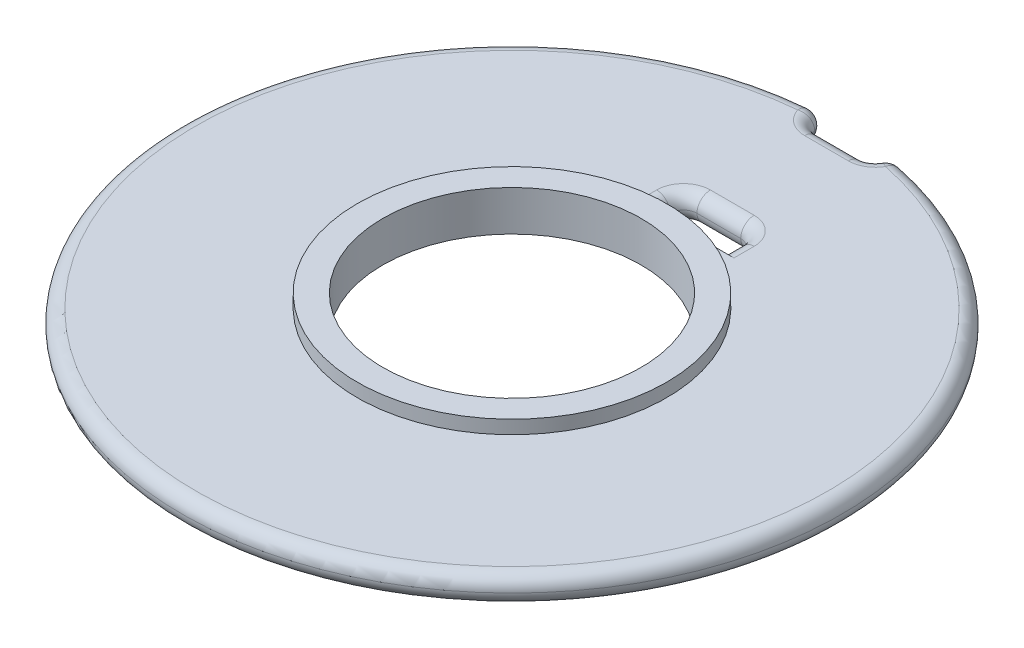
ISO-10303-21;
HEADER;
FILE_DESCRIPTION(('STEP AP214'),'2;1');
FILE_NAME('part.step','',(''),(''),'','','');
FILE_SCHEMA(('AUTOMOTIVE_DESIGN { 1 0 10303 214 1 1 1 1 }'));
ENDSEC;
DATA;
#1=APPLICATION_CONTEXT('core data for automotive mechanical design processes');
#2=APPLICATION_PROTOCOL_DEFINITION('international standard','automotive_design',2000,#1);
#3=PRODUCT_CONTEXT('',#1,'mechanical');
#4=PRODUCT('Part','Part','',(#3));
#5=PRODUCT_RELATED_PRODUCT_CATEGORY('part','',(#4));
#6=PRODUCT_DEFINITION_FORMATION('','',#4);
#7=PRODUCT_DEFINITION_CONTEXT('part definition',#1,'design');
#8=PRODUCT_DEFINITION('design','',#6,#7);
#9=PRODUCT_DEFINITION_SHAPE('','',#8);
#10=(LENGTH_UNIT() NAMED_UNIT(*) SI_UNIT(.MILLI.,.METRE.));
#11=(NAMED_UNIT(*) PLANE_ANGLE_UNIT() SI_UNIT($,.RADIAN.));
#12=(NAMED_UNIT(*) SI_UNIT($,.STERADIAN.) SOLID_ANGLE_UNIT());
#13=UNCERTAINTY_MEASURE_WITH_UNIT(LENGTH_MEASURE(1.E-05),#10,'distance_accuracy_value','');
#14=(GEOMETRIC_REPRESENTATION_CONTEXT(3) GLOBAL_UNCERTAINTY_ASSIGNED_CONTEXT((#13)) GLOBAL_UNIT_ASSIGNED_CONTEXT((#10,
#11,#12)) REPRESENTATION_CONTEXT('',''));
#15=CARTESIAN_POINT('',(0.,0.,0.));
#16=DIRECTION('',(0.,0.,1.));
#17=DIRECTION('',(1.,0.,0.));
#18=AXIS2_PLACEMENT_3D('',#15,#16,#17);
#19=CARTESIAN_POINT('',(9.6,-1.00000000000003,0.));
#20=DIRECTION('',(0.,1.,0.));
#21=DIRECTION('',(-1.,0.,0.));
#22=AXIS2_PLACEMENT_3D('',#19,#20,#21);
#23=PLANE('',#22);
#24=CARTESIAN_POINT('',(3.,-1.00000000000005,-24.));
#25=DIRECTION('',(0.,1.,0.));
#26=DIRECTION('',(-1.,0.,0.));
#27=AXIS2_PLACEMENT_3D('',#24,#25,#26);
#28=CIRCLE('',#27,2.);
#29=CARTESIAN_POINT('',(3.,-1.00000000000005,-22.));
#30=VERTEX_POINT('',#29);
#31=CARTESIAN_POINT('',(4.7415735544358,-1.00000000000004,-23.0166783056955));
#32=VERTEX_POINT('',#31);
#33=EDGE_CURVE('E159',#30,#32,#28,.T.);
#34=ORIENTED_EDGE('',*,*,#33,.T.);
#35=CARTESIAN_POINT('',(0.,-1.00000000000006,0.));
#36=DIRECTION('',(0.,1.,0.));
#37=DIRECTION('',(-1.,0.,0.));
#38=AXIS2_PLACEMENT_3D('',#35,#36,#37);
#39=CIRCLE('',#38,23.5);
#40=CARTESIAN_POINT('',(-2.15809742845385,-1.00000000000007,-23.4006969017869));
#41=VERTEX_POINT('',#40);
#42=EDGE_CURVE('E108',#32,#41,#39,.F.);
#43=ORIENTED_EDGE('',*,*,#42,.T.);
#44=CARTESIAN_POINT('',(-0.249999999999998,-1.00000000000006,-24.));
#45=DIRECTION('',(0.,1.,0.));
#46=DIRECTION('',(-1.,0.,0.));
#47=AXIS2_PLACEMENT_3D('',#44,#45,#46);
#48=CIRCLE('',#47,2.);
#49=CARTESIAN_POINT('',(-0.249999999999998,-1.00000000000006,-22.));
#50=VERTEX_POINT('',#49);
#51=EDGE_CURVE('E156',#41,#50,#48,.T.);
#52=ORIENTED_EDGE('',*,*,#51,.T.);
#53=DIRECTION('',(1.,0.,0.));
#54=VECTOR('',#53,1.);
#55=CARTESIAN_POINT('',(9.6,-1.00000000000003,-22.));
#56=LINE('',#55,#54);
#57=EDGE_CURVE('E162',#50,#30,#56,.T.);
#58=ORIENTED_EDGE('',*,*,#57,.T.);
#59=EDGE_LOOP('',(#34,#43,#52,#58));
#60=FACE_BOUND('',#59,.T.);
#61=DIRECTION('',(1.,0.,0.));
#62=VECTOR('',#61,1.);
#63=CARTESIAN_POINT('',(-1.25,-1.00000000000026,-11.5));
#64=LINE('',#63,#62);
#65=CARTESIAN_POINT('',(-2.25,-1.00000000000007,-11.5));
#66=VERTEX_POINT('',#65);
#67=CARTESIAN_POINT('',(5.,-1.00000000000004,-11.5));
#68=VERTEX_POINT('',#67);
#69=EDGE_CURVE('E258',#66,#68,#64,.T.);
#70=ORIENTED_EDGE('',*,*,#69,.T.);
#71=DIRECTION('',(0.,0.,-1.));
#72=VECTOR('',#71,1.);
#73=CARTESIAN_POINT('',(5.,-1.00000000000004,0.));
#74=LINE('',#73,#72);
#75=CARTESIAN_POINT('',(5.,-1.00000000000004,-13.));
#76=VERTEX_POINT('',#75);
#77=EDGE_CURVE('E231',#68,#76,#74,.T.);
#78=ORIENTED_EDGE('',*,*,#77,.T.);
#79=CARTESIAN_POINT('',(3.,-1.00000000000005,-13.));
#80=DIRECTION('',(0.,1.,0.));
#81=DIRECTION('',(-1.,0.,0.));
#82=AXIS2_PLACEMENT_3D('',#79,#80,#81);
#83=CIRCLE('',#82,2.);
#84=CARTESIAN_POINT('',(3.,-1.00000000000005,-15.));
#85=VERTEX_POINT('',#84);
#86=EDGE_CURVE('E234',#85,#76,#83,.F.);
#87=ORIENTED_EDGE('',*,*,#86,.F.);
#88=DIRECTION('',(-1.,0.,0.));
#89=VECTOR('',#88,1.);
#90=CARTESIAN_POINT('',(9.6,-1.00000000000003,-15.));
#91=LINE('',#90,#89);
#92=CARTESIAN_POINT('',(-0.249999999999998,-1.00000000000006,-15.));
#93=VERTEX_POINT('',#92);
#94=EDGE_CURVE('E240',#85,#93,#91,.T.);
#95=ORIENTED_EDGE('',*,*,#94,.T.);
#96=CARTESIAN_POINT('',(-0.249999999999998,-1.00000000000006,-13.));
#97=DIRECTION('',(0.,1.,0.));
#98=DIRECTION('',(-1.,0.,0.));
#99=AXIS2_PLACEMENT_3D('',#96,#97,#98);
#100=CIRCLE('',#99,2.);
#101=CARTESIAN_POINT('',(-2.25,-1.00000000000007,-13.));
#102=VERTEX_POINT('',#101);
#103=EDGE_CURVE('E243',#102,#93,#100,.F.);
#104=ORIENTED_EDGE('',*,*,#103,.F.);
#105=DIRECTION('',(0.,0.,1.));
#106=VECTOR('',#105,1.);
#107=CARTESIAN_POINT('',(-2.25,-1.00000000000007,0.));
#108=LINE('',#107,#106);
#109=EDGE_CURVE('E237',#102,#66,#108,.T.);
#110=ORIENTED_EDGE('',*,*,#109,.T.);
#111=EDGE_LOOP('',(#70,#78,#87,#95,#104,#110));
#112=FACE_BOUND('',#111,.T.);
#113=CARTESIAN_POINT('',(0.,-1.00000000000003,0.));
#114=DIRECTION('',(0.,1.,0.));
#115=DIRECTION('',(-1.,0.,0.));
#116=AXIS2_PLACEMENT_3D('',#113,#114,#115);
#117=CIRCLE('',#116,9.59999999999997);
#118=CARTESIAN_POINT('',(-9.59999999999995,-1.00000000000007,0.));
#119=VERTEX_POINT('',#118);
#120=EDGE_CURVE('E246',#119,#119,#117,.T.);
#121=ORIENTED_EDGE('',*,*,#120,.T.);
#122=EDGE_LOOP('',(#121));
#123=FACE_BOUND('',#122,.T.);
#124=ADVANCED_FACE('F37',(#60,#112,#123),#23,.F.);
#125=CARTESIAN_POINT('',(24.5,1.00000000000002,0.));
#126=DIRECTION('',(0.,-1.,0.));
#127=DIRECTION('',(1.,0.,0.));
#128=AXIS2_PLACEMENT_3D('',#125,#126,#127);
#129=PLANE('',#128);
#130=DIRECTION('',(0.,0.,-1.));
#131=VECTOR('',#130,1.);
#132=CARTESIAN_POINT('',(5.,0.999999999999953,0.));
#133=LINE('',#132,#131);
#134=CARTESIAN_POINT('',(5.,0.999999999999953,-13.));
#135=VERTEX_POINT('',#134);
#136=CARTESIAN_POINT('',(5.,0.999999999999953,-11.5));
#137=VERTEX_POINT('',#136);
#138=EDGE_CURVE('E216',#135,#137,#133,.F.);
#139=ORIENTED_EDGE('',*,*,#138,.T.);
#140=DIRECTION('',(1.,0.,0.));
#141=VECTOR('',#140,1.);
#142=CARTESIAN_POINT('',(-1.25,0.999999999999931,-11.5));
#143=LINE('',#142,#141);
#144=CARTESIAN_POINT('',(0.,0.999999999999936,-11.5));
#145=VERTEX_POINT('',#144);
#146=EDGE_CURVE('E169',#145,#137,#143,.T.);
#147=ORIENTED_EDGE('',*,*,#146,.F.);
#148=CARTESIAN_POINT('',(0.,0.999999999999957,0.));
#149=DIRECTION('',(0.,1.,0.));
#150=DIRECTION('',(-1.,0.,0.));
#151=AXIS2_PLACEMENT_3D('',#148,#149,#150);
#152=CIRCLE('',#151,11.5);
#153=EDGE_CURVE('E249',#145,#145,#152,.T.);
#154=ORIENTED_EDGE('',*,*,#153,.F.);
#155=CARTESIAN_POINT('',(-2.25,0.999999999999928,-11.5));
#156=VERTEX_POINT('',#155);
#157=EDGE_CURVE('E259',#156,#145,#143,.T.);
#158=ORIENTED_EDGE('',*,*,#157,.F.);
#159=DIRECTION('',(0.,0.,1.));
#160=VECTOR('',#159,1.);
#161=CARTESIAN_POINT('',(-2.25,0.999999999999928,0.));
#162=LINE('',#161,#160);
#163=CARTESIAN_POINT('',(-2.25,0.999999999999928,-13.));
#164=VERTEX_POINT('',#163);
#165=EDGE_CURVE('E219',#156,#164,#162,.F.);
#166=ORIENTED_EDGE('',*,*,#165,.T.);
#167=CARTESIAN_POINT('',(-0.250000000000005,0.999999999999934,-13.));
#168=DIRECTION('',(0.,-1.,0.));
#169=DIRECTION('',(1.,0.,0.));
#170=AXIS2_PLACEMENT_3D('',#167,#168,#169);
#171=CIRCLE('',#170,2.);
#172=CARTESIAN_POINT('',(-0.250000000000005,0.999999999999934,-15.));
#173=VERTEX_POINT('',#172);
#174=EDGE_CURVE('E222',#173,#164,#171,.F.);
#175=ORIENTED_EDGE('',*,*,#174,.F.);
#176=DIRECTION('',(-1.,0.,0.));
#177=VECTOR('',#176,1.);
#178=CARTESIAN_POINT('',(24.5,1.00000000000002,-15.));
#179=LINE('',#178,#177);
#180=CARTESIAN_POINT('',(3.,0.999999999999946,-15.));
#181=VERTEX_POINT('',#180);
#182=EDGE_CURVE('E225',#173,#181,#179,.F.);
#183=ORIENTED_EDGE('',*,*,#182,.T.);
#184=CARTESIAN_POINT('',(3.,0.999999999999946,-13.));
#185=DIRECTION('',(0.,-1.,0.));
#186=DIRECTION('',(1.,0.,0.));
#187=AXIS2_PLACEMENT_3D('',#184,#185,#186);
#188=CIRCLE('',#187,2.);
#189=EDGE_CURVE('E228',#135,#181,#188,.F.);
#190=ORIENTED_EDGE('',*,*,#189,.F.);
#191=EDGE_LOOP('',(#139,#147,#154,#158,#166,#175,#183,#190));
#192=FACE_BOUND('',#191,.T.);
#193=CARTESIAN_POINT('',(-0.250000000000005,0.999999999999934,-24.));
#194=DIRECTION('',(0.,-1.,0.));
#195=DIRECTION('',(1.,0.,0.));
#196=AXIS2_PLACEMENT_3D('',#193,#194,#195);
#197=CIRCLE('',#196,2.);
#198=CARTESIAN_POINT('',(-0.250000000000005,0.999999999999934,-22.));
#199=VERTEX_POINT('',#198);
#200=CARTESIAN_POINT('',(-2.15809742845386,0.999999999999928,-23.4006969017869));
#201=VERTEX_POINT('',#200);
#202=EDGE_CURVE('E102',#199,#201,#197,.T.);
#203=ORIENTED_EDGE('',*,*,#202,.T.);
#204=CARTESIAN_POINT('',(0.,0.999999999999936,0.));
#205=DIRECTION('',(0.,-1.,0.));
#206=DIRECTION('',(1.,0.,0.));
#207=AXIS2_PLACEMENT_3D('',#204,#205,#206);
#208=CIRCLE('',#207,23.5);
#209=CARTESIAN_POINT('',(4.74157355443579,0.999999999999952,-23.0166783056955));
#210=VERTEX_POINT('',#209);
#211=EDGE_CURVE('E56',#201,#210,#208,.F.);
#212=ORIENTED_EDGE('',*,*,#211,.T.);
#213=CARTESIAN_POINT('',(3.,0.999999999999946,-24.));
#214=DIRECTION('',(0.,-1.,0.));
#215=DIRECTION('',(1.,0.,0.));
#216=AXIS2_PLACEMENT_3D('',#213,#214,#215);
#217=CIRCLE('',#216,2.);
#218=CARTESIAN_POINT('',(3.,0.999999999999946,-22.));
#219=VERTEX_POINT('',#218);
#220=EDGE_CURVE('E115',#210,#219,#217,.T.);
#221=ORIENTED_EDGE('',*,*,#220,.T.);
#222=DIRECTION('',(1.,0.,0.));
#223=VECTOR('',#222,1.);
#224=CARTESIAN_POINT('',(24.5,1.00000000000002,-22.));
#225=LINE('',#224,#223);
#226=EDGE_CURVE('E114',#219,#199,#225,.F.);
#227=ORIENTED_EDGE('',*,*,#226,.T.);
#228=EDGE_LOOP('',(#203,#212,#221,#227));
#229=FACE_BOUND('',#228,.T.);
#230=ADVANCED_FACE('F112',(#192,#229),#129,.F.);
#231=CARTESIAN_POINT('',(0.,5.75529788456651,0.));
#232=DIRECTION('',(0.,1.,0.));
#233=DIRECTION('',(-1.,0.,0.));
#234=AXIS2_PLACEMENT_3D('',#231,#232,#233);
#235=CYLINDRICAL_SURFACE('',#234,11.5);
#236=CARTESIAN_POINT('',(0.,1.99999999999996,0.));
#237=DIRECTION('',(0.,1.,0.));
#238=DIRECTION('',(-1.,0.,0.));
#239=AXIS2_PLACEMENT_3D('',#236,#237,#238);
#240=CIRCLE('',#239,11.5);
#241=CARTESIAN_POINT('',(-11.5,1.99999999999992,0.));
#242=VERTEX_POINT('',#241);
#243=EDGE_CURVE('E252',#242,#242,#240,.T.);
#244=ORIENTED_EDGE('',*,*,#243,.F.);
#245=EDGE_LOOP('',(#244));
#246=FACE_BOUND('',#245,.T.);
#247=ORIENTED_EDGE('',*,*,#153,.T.);
#248=EDGE_LOOP('',(#247));
#249=FACE_BOUND('',#248,.T.);
#250=ADVANCED_FACE('F362',(#246,#249),#235,.T.);
#251=CARTESIAN_POINT('',(11.5,2.,0.));
#252=DIRECTION('',(0.,-1.,0.));
#253=DIRECTION('',(1.,0.,0.));
#254=AXIS2_PLACEMENT_3D('',#251,#252,#253);
#255=PLANE('',#254);
#256=CARTESIAN_POINT('',(0.,1.99999999999996,0.));
#257=DIRECTION('',(0.,1.,0.));
#258=DIRECTION('',(-1.,0.,0.));
#259=AXIS2_PLACEMENT_3D('',#256,#257,#258);
#260=CIRCLE('',#259,9.59999999999999);
#261=CARTESIAN_POINT('',(-9.59999999999997,1.99999999999993,0.));
#262=VERTEX_POINT('',#261);
#263=EDGE_CURVE('E255',#262,#262,#260,.T.);
#264=ORIENTED_EDGE('',*,*,#263,.F.);
#265=EDGE_LOOP('',(#264));
#266=FACE_BOUND('',#265,.T.);
#267=ORIENTED_EDGE('',*,*,#243,.T.);
#268=EDGE_LOOP('',(#267));
#269=FACE_BOUND('',#268,.T.);
#270=ADVANCED_FACE('F563',(#266,#269),#255,.F.);
#271=CARTESIAN_POINT('',(0.,5.75529788456651,0.));
#272=DIRECTION('',(0.,1.,0.));
#273=DIRECTION('',(-1.,0.,0.));
#274=AXIS2_PLACEMENT_3D('',#271,#272,#273);
#275=CYLINDRICAL_SURFACE('',#274,9.59999999999998);
#276=ORIENTED_EDGE('',*,*,#120,.F.);
#277=EDGE_LOOP('',(#276));
#278=FACE_BOUND('',#277,.T.);
#279=ORIENTED_EDGE('',*,*,#263,.T.);
#280=EDGE_LOOP('',(#279));
#281=FACE_BOUND('',#280,.T.);
#282=ADVANCED_FACE('F554',(#278,#281),#275,.F.);
#283=CARTESIAN_POINT('',(-1.25,-1.00000000000026,-11.5));
#284=DIRECTION('',(0.,0.,1.));
#285=DIRECTION('',(1.,0.,0.));
#286=AXIS2_PLACEMENT_3D('',#283,#284,#285);
#287=PLANE('',#286);
#288=ORIENTED_EDGE('',*,*,#157,.T.);
#289=ORIENTED_EDGE('',*,*,#146,.T.);
#290=CARTESIAN_POINT('',(5.,0.,-11.5));
#291=DIRECTION('',(0.,0.,1.));
#292=DIRECTION('',(1.,0.,0.));
#293=AXIS2_PLACEMENT_3D('',#290,#291,#292);
#294=CIRCLE('',#293,1.);
#295=CARTESIAN_POINT('',(4.,0.,-11.5));
#296=VERTEX_POINT('',#295);
#297=EDGE_CURVE('E210',#137,#296,#294,.T.);
#298=ORIENTED_EDGE('',*,*,#297,.T.);
#299=CARTESIAN_POINT('',(5.,0.,-11.5));
#300=DIRECTION('',(0.,0.,1.));
#301=DIRECTION('',(1.,0.,0.));
#302=AXIS2_PLACEMENT_3D('',#299,#300,#301);
#303=CIRCLE('',#302,1.);
#304=EDGE_CURVE('E213',#296,#68,#303,.T.);
#305=ORIENTED_EDGE('',*,*,#304,.T.);
#306=ORIENTED_EDGE('',*,*,#69,.F.);
#307=CARTESIAN_POINT('',(-2.25,0.,-11.5));
#308=DIRECTION('',(0.,0.,1.));
#309=DIRECTION('',(1.,0.,0.));
#310=AXIS2_PLACEMENT_3D('',#307,#308,#309);
#311=CIRCLE('',#310,1.);
#312=CARTESIAN_POINT('',(-1.25,0.,-11.5));
#313=VERTEX_POINT('',#312);
#314=EDGE_CURVE('E207',#66,#313,#311,.T.);
#315=ORIENTED_EDGE('',*,*,#314,.T.);
#316=CARTESIAN_POINT('',(-2.25,0.,-11.5));
#317=DIRECTION('',(0.,0.,1.));
#318=DIRECTION('',(1.,0.,0.));
#319=AXIS2_PLACEMENT_3D('',#316,#317,#318);
#320=CIRCLE('',#319,1.);
#321=EDGE_CURVE('E165',#313,#156,#320,.T.);
#322=ORIENTED_EDGE('',*,*,#321,.T.);
#323=EDGE_LOOP('',(#288,#289,#298,#305,#306,#315,#322));
#324=FACE_BOUND('',#323,.T.);
#325=ADVANCED_FACE('F278',(#324),#287,.F.);
#326=CARTESIAN_POINT('',(-2.25,0.,-14.));
#327=DIRECTION('',(0.,0.,1.));
#328=DIRECTION('',(1.,0.,0.));
#329=AXIS2_PLACEMENT_3D('',#326,#327,#328);
#330=CYLINDRICAL_SURFACE('',#329,1.);
#331=ORIENTED_EDGE('',*,*,#165,.F.);
#332=ORIENTED_EDGE('',*,*,#321,.F.);
#333=DIRECTION('',(0.,0.,1.));
#334=VECTOR('',#333,1.);
#335=CARTESIAN_POINT('',(-1.25,0.,-14.));
#336=LINE('',#335,#334);
#337=CARTESIAN_POINT('',(-1.25,0.,-13.));
#338=VERTEX_POINT('',#337);
#339=EDGE_CURVE('E166',#338,#313,#336,.T.);
#340=ORIENTED_EDGE('',*,*,#339,.F.);
#341=CARTESIAN_POINT('',(-2.25,0.,-13.));
#342=DIRECTION('',(0.,0.,-1.));
#343=DIRECTION('',(-1.,0.,0.));
#344=AXIS2_PLACEMENT_3D('',#341,#342,#343);
#345=CIRCLE('',#344,1.);
#346=EDGE_CURVE('E170',#164,#338,#345,.T.);
#347=ORIENTED_EDGE('',*,*,#346,.F.);
#348=EDGE_LOOP('',(#331,#332,#340,#347));
#349=FACE_BOUND('',#348,.T.);
#350=ADVANCED_FACE('F393',(#349),#330,.T.);
#351=CARTESIAN_POINT('',(-2.25,0.,0.));
#352=DIRECTION('',(0.,0.,1.));
#353=DIRECTION('',(1.,0.,0.));
#354=AXIS2_PLACEMENT_3D('',#351,#352,#353);
#355=CYLINDRICAL_SURFACE('',#354,1.);
#356=CARTESIAN_POINT('',(-2.25,0.,-13.));
#357=DIRECTION('',(0.,0.,-1.));
#358=DIRECTION('',(-1.,0.,0.));
#359=AXIS2_PLACEMENT_3D('',#356,#357,#358);
#360=CIRCLE('',#359,1.);
#361=EDGE_CURVE('E173',#338,#102,#360,.T.);
#362=ORIENTED_EDGE('',*,*,#361,.F.);
#363=ORIENTED_EDGE('',*,*,#339,.T.);
#364=ORIENTED_EDGE('',*,*,#314,.F.);
#365=ORIENTED_EDGE('',*,*,#109,.F.);
#366=EDGE_LOOP('',(#362,#363,#364,#365));
#367=FACE_BOUND('',#366,.T.);
#368=ADVANCED_FACE('F390',(#367),#355,.T.);
#369=CARTESIAN_POINT('',(-0.250000000000001,0.,-13.));
#370=DIRECTION('',(0.,-1.,0.));
#371=DIRECTION('',(1.,0.,0.));
#372=AXIS2_PLACEMENT_3D('',#369,#370,#371);
#373=TOROIDAL_SURFACE('',#372,2.,1.);
#374=ORIENTED_EDGE('',*,*,#346,.T.);
#375=CARTESIAN_POINT('',(-0.250000000000001,0.,-13.));
#376=DIRECTION('',(0.,1.,0.));
#377=DIRECTION('',(-1.,0.,0.));
#378=AXIS2_PLACEMENT_3D('',#375,#376,#377);
#379=CIRCLE('',#378,1.);
#380=CARTESIAN_POINT('',(-0.250000000000001,0.,-14.));
#381=VERTEX_POINT('',#380);
#382=EDGE_CURVE('E176',#381,#338,#379,.T.);
#383=ORIENTED_EDGE('',*,*,#382,.F.);
#384=CARTESIAN_POINT('',(-0.250000000000001,0.,-15.));
#385=DIRECTION('',(-1.,0.,0.));
#386=DIRECTION('',(0.,-1.,0.));
#387=AXIS2_PLACEMENT_3D('',#384,#385,#386);
#388=CIRCLE('',#387,1.);
#389=EDGE_CURVE('E179',#173,#381,#388,.F.);
#390=ORIENTED_EDGE('',*,*,#389,.F.);
#391=ORIENTED_EDGE('',*,*,#174,.T.);
#392=EDGE_LOOP('',(#374,#383,#390,#391));
#393=FACE_BOUND('',#392,.T.);
#394=ADVANCED_FACE('F387',(#393),#373,.T.);
#395=CARTESIAN_POINT('',(-0.250000000000001,0.,-13.));
#396=DIRECTION('',(0.,1.,0.));
#397=DIRECTION('',(-1.,0.,0.));
#398=AXIS2_PLACEMENT_3D('',#395,#396,#397);
#399=TOROIDAL_SURFACE('',#398,2.,1.);
#400=ORIENTED_EDGE('',*,*,#361,.T.);
#401=ORIENTED_EDGE('',*,*,#103,.T.);
#402=CARTESIAN_POINT('',(-0.250000000000001,0.,-15.));
#403=DIRECTION('',(-1.,0.,0.));
#404=DIRECTION('',(0.,-1.,0.));
#405=AXIS2_PLACEMENT_3D('',#402,#403,#404);
#406=CIRCLE('',#405,1.);
#407=EDGE_CURVE('E185',#381,#93,#406,.F.);
#408=ORIENTED_EDGE('',*,*,#407,.F.);
#409=ORIENTED_EDGE('',*,*,#382,.T.);
#410=EDGE_LOOP('',(#400,#401,#408,#409));
#411=FACE_BOUND('',#410,.T.);
#412=ADVANCED_FACE('F303',(#411),#399,.T.);
#413=CARTESIAN_POINT('',(-1.25,0.,-15.));
#414=DIRECTION('',(-1.,0.,0.));
#415=DIRECTION('',(0.,-1.,0.));
#416=AXIS2_PLACEMENT_3D('',#413,#414,#415);
#417=CYLINDRICAL_SURFACE('',#416,1.);
#418=CARTESIAN_POINT('',(3.,0.,-15.));
#419=DIRECTION('',(1.,0.,0.));
#420=DIRECTION('',(0.,1.,0.));
#421=AXIS2_PLACEMENT_3D('',#418,#419,#420);
#422=CIRCLE('',#421,1.);
#423=CARTESIAN_POINT('',(3.,0.,-14.));
#424=VERTEX_POINT('',#423);
#425=EDGE_CURVE('E182',#181,#424,#422,.T.);
#426=ORIENTED_EDGE('',*,*,#425,.F.);
#427=ORIENTED_EDGE('',*,*,#182,.F.);
#428=ORIENTED_EDGE('',*,*,#389,.T.);
#429=DIRECTION('',(-1.,0.,0.));
#430=VECTOR('',#429,1.);
#431=CARTESIAN_POINT('',(-1.25,0.,-14.));
#432=LINE('',#431,#430);
#433=EDGE_CURVE('E188',#424,#381,#432,.T.);
#434=ORIENTED_EDGE('',*,*,#433,.F.);
#435=EDGE_LOOP('',(#426,#427,#428,#434));
#436=FACE_BOUND('',#435,.T.);
#437=ADVANCED_FACE('F380',(#436),#417,.T.);
#438=CARTESIAN_POINT('',(3.,0.,-13.));
#439=DIRECTION('',(0.,-1.,0.));
#440=DIRECTION('',(1.,0.,0.));
#441=AXIS2_PLACEMENT_3D('',#438,#439,#440);
#442=TOROIDAL_SURFACE('',#441,2.,1.);
#443=ORIENTED_EDGE('',*,*,#189,.T.);
#444=ORIENTED_EDGE('',*,*,#425,.T.);
#445=CARTESIAN_POINT('',(3.,0.,-13.));
#446=DIRECTION('',(0.,-1.,0.));
#447=DIRECTION('',(1.,0.,0.));
#448=AXIS2_PLACEMENT_3D('',#445,#446,#447);
#449=CIRCLE('',#448,1.);
#450=CARTESIAN_POINT('',(4.,0.,-13.));
#451=VERTEX_POINT('',#450);
#452=EDGE_CURVE('E191',#451,#424,#449,.F.);
#453=ORIENTED_EDGE('',*,*,#452,.F.);
#454=CARTESIAN_POINT('',(5.,0.,-13.));
#455=DIRECTION('',(0.,0.,-1.));
#456=DIRECTION('',(-1.,0.,0.));
#457=AXIS2_PLACEMENT_3D('',#454,#455,#456);
#458=CIRCLE('',#457,1.);
#459=EDGE_CURVE('E194',#135,#451,#458,.F.);
#460=ORIENTED_EDGE('',*,*,#459,.F.);
#461=EDGE_LOOP('',(#443,#444,#453,#460));
#462=FACE_BOUND('',#461,.T.);
#463=ADVANCED_FACE('F377',(#462),#442,.T.);
#464=CARTESIAN_POINT('',(9.6,0.,-15.));
#465=DIRECTION('',(-1.,0.,0.));
#466=DIRECTION('',(0.,-1.,0.));
#467=AXIS2_PLACEMENT_3D('',#464,#465,#466);
#468=CYLINDRICAL_SURFACE('',#467,1.);
#469=ORIENTED_EDGE('',*,*,#407,.T.);
#470=ORIENTED_EDGE('',*,*,#94,.F.);
#471=CARTESIAN_POINT('',(3.,0.,-15.));
#472=DIRECTION('',(1.,0.,0.));
#473=DIRECTION('',(0.,1.,0.));
#474=AXIS2_PLACEMENT_3D('',#471,#472,#473);
#475=CIRCLE('',#474,1.);
#476=EDGE_CURVE('E197',#424,#85,#475,.T.);
#477=ORIENTED_EDGE('',*,*,#476,.F.);
#478=ORIENTED_EDGE('',*,*,#433,.T.);
#479=EDGE_LOOP('',(#469,#470,#477,#478));
#480=FACE_BOUND('',#479,.T.);
#481=ADVANCED_FACE('F295',(#480),#468,.T.);
#482=CARTESIAN_POINT('',(5.,0.,-14.));
#483=DIRECTION('',(0.,0.,-1.));
#484=DIRECTION('',(-1.,0.,0.));
#485=AXIS2_PLACEMENT_3D('',#482,#483,#484);
#486=CYLINDRICAL_SURFACE('',#485,1.);
#487=ORIENTED_EDGE('',*,*,#138,.F.);
#488=ORIENTED_EDGE('',*,*,#459,.T.);
#489=DIRECTION('',(0.,0.,-1.));
#490=VECTOR('',#489,1.);
#491=CARTESIAN_POINT('',(4.,0.,-14.));
#492=LINE('',#491,#490);
#493=EDGE_CURVE('E200',#296,#451,#492,.T.);
#494=ORIENTED_EDGE('',*,*,#493,.F.);
#495=ORIENTED_EDGE('',*,*,#297,.F.);
#496=EDGE_LOOP('',(#487,#488,#494,#495));
#497=FACE_BOUND('',#496,.T.);
#498=ADVANCED_FACE('F371',(#497),#486,.T.);
#499=CARTESIAN_POINT('',(3.,0.,-13.));
#500=DIRECTION('',(0.,1.,0.));
#501=DIRECTION('',(-1.,0.,0.));
#502=AXIS2_PLACEMENT_3D('',#499,#500,#501);
#503=TOROIDAL_SURFACE('',#502,2.,1.);
#504=ORIENTED_EDGE('',*,*,#476,.T.);
#505=ORIENTED_EDGE('',*,*,#86,.T.);
#506=CARTESIAN_POINT('',(5.,0.,-13.));
#507=DIRECTION('',(0.,0.,-1.));
#508=DIRECTION('',(-1.,0.,0.));
#509=AXIS2_PLACEMENT_3D('',#506,#507,#508);
#510=CIRCLE('',#509,1.);
#511=EDGE_CURVE('E139',#451,#76,#510,.F.);
#512=ORIENTED_EDGE('',*,*,#511,.F.);
#513=ORIENTED_EDGE('',*,*,#452,.T.);
#514=EDGE_LOOP('',(#504,#505,#512,#513));
#515=FACE_BOUND('',#514,.T.);
#516=ADVANCED_FACE('F288',(#515),#503,.T.);
#517=CARTESIAN_POINT('',(5.,0.,0.));
#518=DIRECTION('',(0.,0.,-1.));
#519=DIRECTION('',(-1.,0.,0.));
#520=AXIS2_PLACEMENT_3D('',#517,#518,#519);
#521=CYLINDRICAL_SURFACE('',#520,1.);
#522=ORIENTED_EDGE('',*,*,#304,.F.);
#523=ORIENTED_EDGE('',*,*,#493,.T.);
#524=ORIENTED_EDGE('',*,*,#511,.T.);
#525=ORIENTED_EDGE('',*,*,#77,.F.);
#526=EDGE_LOOP('',(#522,#523,#524,#525));
#527=FACE_BOUND('',#526,.T.);
#528=ADVANCED_FACE('F284',(#527),#521,.T.);
#529=CARTESIAN_POINT('',(3.,0.,-24.));
#530=DIRECTION('',(0.,-1.,0.));
#531=DIRECTION('',(1.,0.,0.));
#532=AXIS2_PLACEMENT_3D('',#529,#530,#531);
#533=TOROIDAL_SURFACE('',#532,2.,1.);
#534=ORIENTED_EDGE('',*,*,#220,.F.);
#535=CARTESIAN_POINT('',(4.7415735544358,0.,-23.0166783056955));
#536=DIRECTION('',(-0.491660847152249,0.,0.870786777217898));
#537=DIRECTION('',(0.870786777217898,0.,0.491660847152249));
#538=AXIS2_PLACEMENT_3D('',#535,#536,#537);
#539=CIRCLE('',#538,1.);
#540=CARTESIAN_POINT('',(3.8707867772179,0.,-23.5083391528477));
#541=VERTEX_POINT('',#540);
#542=EDGE_CURVE('E47',#210,#541,#539,.T.);
#543=ORIENTED_EDGE('',*,*,#542,.T.);
#544=CARTESIAN_POINT('',(3.,0.,-24.));
#545=DIRECTION('',(0.,-1.,0.));
#546=DIRECTION('',(1.,0.,0.));
#547=AXIS2_PLACEMENT_3D('',#544,#545,#546);
#548=CIRCLE('',#547,1.);
#549=CARTESIAN_POINT('',(3.,0.,-23.));
#550=VERTEX_POINT('',#549);
#551=EDGE_CURVE('E136',#550,#541,#548,.F.);
#552=ORIENTED_EDGE('',*,*,#551,.F.);
#553=CARTESIAN_POINT('',(3.,0.,-22.));
#554=DIRECTION('',(-1.,0.,0.));
#555=DIRECTION('',(0.,-1.,0.));
#556=AXIS2_PLACEMENT_3D('',#553,#554,#555);
#557=CIRCLE('',#556,1.);
#558=EDGE_CURVE('E140',#219,#550,#557,.T.);
#559=ORIENTED_EDGE('',*,*,#558,.F.);
#560=EDGE_LOOP('',(#534,#543,#552,#559));
#561=FACE_BOUND('',#560,.T.);
#562=ADVANCED_FACE('F324',(#561),#533,.T.);
#563=CARTESIAN_POINT('',(3.,0.,-24.));
#564=DIRECTION('',(0.,1.,0.));
#565=DIRECTION('',(-1.,0.,0.));
#566=AXIS2_PLACEMENT_3D('',#563,#564,#565);
#567=TOROIDAL_SURFACE('',#566,2.,1.);
#568=ORIENTED_EDGE('',*,*,#551,.T.);
#569=CARTESIAN_POINT('',(4.7415735544358,0.,-23.0166783056955));
#570=DIRECTION('',(0.491660847152249,0.,-0.870786777217898));
#571=DIRECTION('',(-0.870786777217898,0.,-0.491660847152249));
#572=AXIS2_PLACEMENT_3D('',#569,#570,#571);
#573=CIRCLE('',#572,1.);
#574=EDGE_CURVE('E11',#541,#32,#573,.F.);
#575=ORIENTED_EDGE('',*,*,#574,.T.);
#576=ORIENTED_EDGE('',*,*,#33,.F.);
#577=CARTESIAN_POINT('',(3.,0.,-22.));
#578=DIRECTION('',(-1.,0.,0.));
#579=DIRECTION('',(0.,-1.,0.));
#580=AXIS2_PLACEMENT_3D('',#577,#578,#579);
#581=CIRCLE('',#580,1.);
#582=EDGE_CURVE('E144',#550,#30,#581,.T.);
#583=ORIENTED_EDGE('',*,*,#582,.F.);
#584=EDGE_LOOP('',(#568,#575,#576,#583));
#585=FACE_BOUND('',#584,.T.);
#586=ADVANCED_FACE('F340',(#585),#567,.T.);
#587=CARTESIAN_POINT('',(-1.25,0.,-22.));
#588=DIRECTION('',(1.,0.,0.));
#589=DIRECTION('',(0.,1.,0.));
#590=AXIS2_PLACEMENT_3D('',#587,#588,#589);
#591=CYLINDRICAL_SURFACE('',#590,1.);
#592=CARTESIAN_POINT('',(-0.250000000000001,0.,-22.));
#593=DIRECTION('',(-1.,0.,0.));
#594=DIRECTION('',(0.,-1.,0.));
#595=AXIS2_PLACEMENT_3D('',#592,#593,#594);
#596=CIRCLE('',#595,1.);
#597=CARTESIAN_POINT('',(-0.250000000000001,0.,-23.));
#598=VERTEX_POINT('',#597);
#599=EDGE_CURVE('E82',#199,#598,#596,.T.);
#600=ORIENTED_EDGE('',*,*,#599,.F.);
#601=ORIENTED_EDGE('',*,*,#226,.F.);
#602=ORIENTED_EDGE('',*,*,#558,.T.);
#603=DIRECTION('',(1.,0.,0.));
#604=VECTOR('',#603,1.);
#605=CARTESIAN_POINT('',(-1.25,0.,-23.));
#606=LINE('',#605,#604);
#607=EDGE_CURVE('E147',#598,#550,#606,.T.);
#608=ORIENTED_EDGE('',*,*,#607,.F.);
#609=EDGE_LOOP('',(#600,#601,#602,#608));
#610=FACE_BOUND('',#609,.T.);
#611=ADVANCED_FACE('F327',(#610),#591,.T.);
#612=CARTESIAN_POINT('',(-0.250000000000001,0.,-24.));
#613=DIRECTION('',(0.,-1.,0.));
#614=DIRECTION('',(1.,0.,0.));
#615=AXIS2_PLACEMENT_3D('',#612,#613,#614);
#616=TOROIDAL_SURFACE('',#615,2.,1.);
#617=CARTESIAN_POINT('',(-0.250000000000001,0.,-24.));
#618=DIRECTION('',(0.,-1.,0.));
#619=DIRECTION('',(1.,0.,0.));
#620=AXIS2_PLACEMENT_3D('',#617,#618,#619);
#621=CIRCLE('',#620,1.);
#622=CARTESIAN_POINT('',(-1.20404871422693,0.,-23.7003484508935));
#623=VERTEX_POINT('',#622);
#624=EDGE_CURVE('E104',#623,#598,#621,.F.);
#625=ORIENTED_EDGE('',*,*,#624,.F.);
#626=CARTESIAN_POINT('',(-2.15809742845385,0.,-23.4006969017869));
#627=DIRECTION('',(-0.299651549106541,0.,-0.954048714226926));
#628=DIRECTION('',(-0.954048714226926,0.,0.299651549106541));
#629=AXIS2_PLACEMENT_3D('',#626,#627,#628);
#630=CIRCLE('',#629,1.);
#631=EDGE_CURVE('E100',#623,#201,#630,.F.);
#632=ORIENTED_EDGE('',*,*,#631,.T.);
#633=ORIENTED_EDGE('',*,*,#202,.F.);
#634=ORIENTED_EDGE('',*,*,#599,.T.);
#635=EDGE_LOOP('',(#625,#632,#633,#634));
#636=FACE_BOUND('',#635,.T.);
#637=ADVANCED_FACE('F101',(#636),#616,.T.);
#638=CARTESIAN_POINT('',(9.6,0.,-22.));
#639=DIRECTION('',(1.,0.,0.));
#640=DIRECTION('',(0.,1.,0.));
#641=AXIS2_PLACEMENT_3D('',#638,#639,#640);
#642=CYLINDRICAL_SURFACE('',#641,1.);
#643=ORIENTED_EDGE('',*,*,#582,.T.);
#644=ORIENTED_EDGE('',*,*,#57,.F.);
#645=CARTESIAN_POINT('',(-0.250000000000001,0.,-22.));
#646=DIRECTION('',(-1.,0.,0.));
#647=DIRECTION('',(0.,-1.,0.));
#648=AXIS2_PLACEMENT_3D('',#645,#646,#647);
#649=CIRCLE('',#648,1.);
#650=EDGE_CURVE('E151',#598,#50,#649,.T.);
#651=ORIENTED_EDGE('',*,*,#650,.F.);
#652=ORIENTED_EDGE('',*,*,#607,.T.);
#653=EDGE_LOOP('',(#643,#644,#651,#652));
#654=FACE_BOUND('',#653,.T.);
#655=ADVANCED_FACE('F335',(#654),#642,.T.);
#656=CARTESIAN_POINT('',(-0.250000000000001,0.,-24.));
#657=DIRECTION('',(0.,1.,0.));
#658=DIRECTION('',(-1.,0.,0.));
#659=AXIS2_PLACEMENT_3D('',#656,#657,#658);
#660=TOROIDAL_SURFACE('',#659,2.,1.);
#661=ORIENTED_EDGE('',*,*,#51,.F.);
#662=CARTESIAN_POINT('',(-2.15809742845385,0.,-23.4006969017869));
#663=DIRECTION('',(0.299651549106541,0.,0.954048714226926));
#664=DIRECTION('',(0.954048714226926,0.,-0.299651549106541));
#665=AXIS2_PLACEMENT_3D('',#662,#663,#664);
#666=CIRCLE('',#665,1.);
#667=EDGE_CURVE('E109',#41,#623,#666,.T.);
#668=ORIENTED_EDGE('',*,*,#667,.T.);
#669=ORIENTED_EDGE('',*,*,#624,.T.);
#670=ORIENTED_EDGE('',*,*,#650,.T.);
#671=EDGE_LOOP('',(#661,#668,#669,#670));
#672=FACE_BOUND('',#671,.T.);
#673=ADVANCED_FACE('F332',(#672),#660,.T.);
#674=CARTESIAN_POINT('',(4.7415735544358,0.,-23.0166783056955));
#675=DIRECTION('',(-0.201769087422799,0.,0.979433119391299));
#676=DIRECTION('',(0.979433119391299,0.,0.201769087422799));
#677=AXIS2_PLACEMENT_3D('',#674,#675,#676);
#678=SPHERICAL_SURFACE('',#677,1.);
#679=CARTESIAN_POINT('',(4.7415735544358,0.,-23.0166783056955));
#680=DIRECTION('',(0.,-1.,0.));
#681=DIRECTION('',(1.,0.,0.));
#682=AXIS2_PLACEMENT_3D('',#679,#680,#681);
#683=CIRCLE('',#682,1.);
#684=CARTESIAN_POINT('',(4.9433426418586,0.,-23.9961114250868));
#685=VERTEX_POINT('',#684);
#686=EDGE_CURVE('E122',#541,#685,#683,.T.);
#687=ORIENTED_EDGE('',*,*,#686,.F.);
#688=ORIENTED_EDGE('',*,*,#542,.F.);
#689=CARTESIAN_POINT('',(4.7415735544358,0.,-23.0166783056955));
#690=DIRECTION('',(0.979433119391299,0.,0.201769087422799));
#691=DIRECTION('',(0.201769087422799,0.,-0.979433119391299));
#692=AXIS2_PLACEMENT_3D('',#689,#690,#691);
#693=CIRCLE('',#692,1.);
#694=EDGE_CURVE('E41',#685,#210,#693,.T.);
#695=ORIENTED_EDGE('',*,*,#694,.F.);
#696=EDGE_LOOP('',(#687,#688,#695));
#697=FACE_BOUND('',#696,.T.);
#698=ADVANCED_FACE('F39',(#697),#678,.T.);
#699=CARTESIAN_POINT('',(0.,0.,0.));
#700=DIRECTION('',(0.,-1.,0.));
#701=DIRECTION('',(1.,0.,0.));
#702=AXIS2_PLACEMENT_3D('',#699,#700,#701);
#703=TOROIDAL_SURFACE('',#702,23.5,1.);
#704=ORIENTED_EDGE('',*,*,#694,.T.);
#705=ORIENTED_EDGE('',*,*,#211,.F.);
#706=CARTESIAN_POINT('',(-2.15809742845386,0.,-23.4006969017869));
#707=DIRECTION('',(0.995774336246253,0.,-0.091833933125697));
#708=DIRECTION('',(-0.091833933125697,0.,-0.995774336246253));
#709=AXIS2_PLACEMENT_3D('',#706,#707,#708);
#710=CIRCLE('',#709,1.);
#711=CARTESIAN_POINT('',(-2.24993136157955,0.,-24.3964712380332));
#712=VERTEX_POINT('',#711);
#713=EDGE_CURVE('E66',#712,#201,#710,.T.);
#714=ORIENTED_EDGE('',*,*,#713,.F.);
#715=CARTESIAN_POINT('',(0.,0.,0.));
#716=DIRECTION('',(0.,-1.,0.));
#717=DIRECTION('',(1.,0.,0.));
#718=AXIS2_PLACEMENT_3D('',#715,#716,#717);
#719=CIRCLE('',#718,24.5);
#720=EDGE_CURVE('E123',#685,#712,#719,.T.);
#721=ORIENTED_EDGE('',*,*,#720,.F.);
#722=EDGE_LOOP('',(#704,#705,#714,#721));
#723=FACE_BOUND('',#722,.T.);
#724=ADVANCED_FACE('F117',(#723),#703,.T.);
#725=CARTESIAN_POINT('',(4.7415735544358,0.,-23.0166783056955));
#726=DIRECTION('',(-0.201769087422799,0.,0.979433119391299));
#727=DIRECTION('',(0.979433119391299,0.,0.201769087422799));
#728=AXIS2_PLACEMENT_3D('',#725,#726,#727);
#729=SPHERICAL_SURFACE('',#728,1.);
#730=ORIENTED_EDGE('',*,*,#574,.F.);
#731=ORIENTED_EDGE('',*,*,#686,.T.);
#732=CARTESIAN_POINT('',(4.7415735544358,0.,-23.0166783056955));
#733=DIRECTION('',(0.979433119391299,0.,0.2017690874228));
#734=DIRECTION('',(0.2017690874228,0.,-0.979433119391299));
#735=AXIS2_PLACEMENT_3D('',#732,#733,#734);
#736=CIRCLE('',#735,1.);
#737=EDGE_CURVE('E125',#32,#685,#736,.T.);
#738=ORIENTED_EDGE('',*,*,#737,.F.);
#739=EDGE_LOOP('',(#730,#731,#738));
#740=FACE_BOUND('',#739,.T.);
#741=ADVANCED_FACE('F343',(#740),#729,.T.);
#742=CARTESIAN_POINT('',(0.,0.,0.));
#743=DIRECTION('',(0.,1.,0.));
#744=DIRECTION('',(-1.,0.,0.));
#745=AXIS2_PLACEMENT_3D('',#742,#743,#744);
#746=TOROIDAL_SURFACE('',#745,23.5,1.);
#747=ORIENTED_EDGE('',*,*,#737,.T.);
#748=ORIENTED_EDGE('',*,*,#720,.T.);
#749=CARTESIAN_POINT('',(-2.15809742845386,0.,-23.4006969017869));
#750=DIRECTION('',(0.995774336246253,0.,-0.0918339331256967));
#751=DIRECTION('',(-0.0918339331256967,0.,-0.995774336246253));
#752=AXIS2_PLACEMENT_3D('',#749,#750,#751);
#753=CIRCLE('',#752,1.);
#754=EDGE_CURVE('E130',#41,#712,#753,.T.);
#755=ORIENTED_EDGE('',*,*,#754,.F.);
#756=ORIENTED_EDGE('',*,*,#42,.F.);
#757=EDGE_LOOP('',(#747,#748,#755,#756));
#758=FACE_BOUND('',#757,.T.);
#759=ADVANCED_FACE('F347',(#758),#746,.T.);
#760=CARTESIAN_POINT('',(-2.15809742845386,0.,-23.4006969017869));
#761=DIRECTION('',(0.,0.,1.));
#762=DIRECTION('',(1.,0.,0.));
#763=AXIS2_PLACEMENT_3D('',#760,#761,#762);
#764=SPHERICAL_SURFACE('',#763,1.);
#765=ORIENTED_EDGE('',*,*,#713,.T.);
#766=ORIENTED_EDGE('',*,*,#631,.F.);
#767=CARTESIAN_POINT('',(-2.15809742845386,0.,-23.4006969017869));
#768=DIRECTION('',(0.,1.,0.));
#769=DIRECTION('',(-1.,0.,0.));
#770=AXIS2_PLACEMENT_3D('',#767,#768,#769);
#771=CIRCLE('',#770,1.);
#772=EDGE_CURVE('E120',#712,#623,#771,.F.);
#773=ORIENTED_EDGE('',*,*,#772,.F.);
#774=EDGE_LOOP('',(#765,#766,#773));
#775=FACE_BOUND('',#774,.T.);
#776=ADVANCED_FACE('F119',(#775),#764,.T.);
#777=CARTESIAN_POINT('',(-2.15809742845386,0.,-23.4006969017869));
#778=DIRECTION('',(0.,0.,1.));
#779=DIRECTION('',(1.,0.,0.));
#780=AXIS2_PLACEMENT_3D('',#777,#778,#779);
#781=SPHERICAL_SURFACE('',#780,1.);
#782=ORIENTED_EDGE('',*,*,#754,.T.);
#783=ORIENTED_EDGE('',*,*,#772,.T.);
#784=ORIENTED_EDGE('',*,*,#667,.F.);
#785=EDGE_LOOP('',(#782,#783,#784));
#786=FACE_BOUND('',#785,.T.);
#787=ADVANCED_FACE('F349',(#786),#781,.T.);
#788=CLOSED_SHELL('',(#124,#230,#250,#270,#282,#325,#350,#368,#394,#412,#437,#463,#481,#498,
#516,#528,#562,#586,#611,#637,#655,#673,#698,#724,#741,#759,#776,#787));
#789=MANIFOLD_SOLID_BREP('B2',#788);
#790=ADVANCED_BREP_SHAPE_REPRESENTATION('',(#18,#789),#14);
#791=SHAPE_DEFINITION_REPRESENTATION(#9,#790);
ENDSEC;
END-ISO-10303-21;
